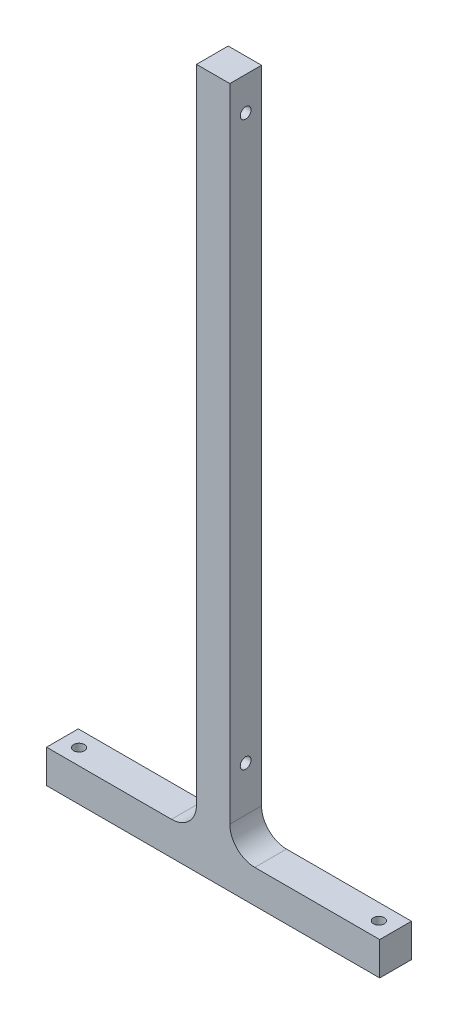
ISO-10303-21;
HEADER;
FILE_DESCRIPTION(('STEP AP214'),'2;1');
FILE_NAME('part.step','',(''),(''),'','','');
FILE_SCHEMA(('AUTOMOTIVE_DESIGN { 1 0 10303 214 1 1 1 1 }'));
ENDSEC;
DATA;
#1=APPLICATION_CONTEXT('core data for automotive mechanical design processes');
#2=APPLICATION_PROTOCOL_DEFINITION('international standard','automotive_design',2000,#1);
#3=PRODUCT_CONTEXT('',#1,'mechanical');
#4=PRODUCT('Part','Part','',(#3));
#5=PRODUCT_RELATED_PRODUCT_CATEGORY('part','',(#4));
#6=PRODUCT_DEFINITION_FORMATION('','',#4);
#7=PRODUCT_DEFINITION_CONTEXT('part definition',#1,'design');
#8=PRODUCT_DEFINITION('design','',#6,#7);
#9=PRODUCT_DEFINITION_SHAPE('','',#8);
#10=(LENGTH_UNIT() NAMED_UNIT(*) SI_UNIT(.MILLI.,.METRE.));
#11=(NAMED_UNIT(*) PLANE_ANGLE_UNIT() SI_UNIT($,.RADIAN.));
#12=(NAMED_UNIT(*) SI_UNIT($,.STERADIAN.) SOLID_ANGLE_UNIT());
#13=UNCERTAINTY_MEASURE_WITH_UNIT(LENGTH_MEASURE(1.E-05),#10,'distance_accuracy_value','');
#14=(GEOMETRIC_REPRESENTATION_CONTEXT(3) GLOBAL_UNCERTAINTY_ASSIGNED_CONTEXT((#13)) GLOBAL_UNIT_ASSIGNED_CONTEXT((#10,
#11,#12)) REPRESENTATION_CONTEXT('',''));
#15=CARTESIAN_POINT('',(0.,0.,0.));
#16=DIRECTION('',(0.,0.,1.));
#17=DIRECTION('',(1.,0.,0.));
#18=AXIS2_PLACEMENT_3D('',#15,#16,#17);
#19=CARTESIAN_POINT('',(-50.,10.,9.525));
#20=DIRECTION('',(1.,0.,0.));
#21=DIRECTION('',(0.,0.,-1.));
#22=AXIS2_PLACEMENT_3D('',#19,#20,#21);
#23=PLANE('',#22);
#24=DIRECTION('',(0.,-1.,0.));
#25=VECTOR('',#24,1.);
#26=CARTESIAN_POINT('',(-50.,10.,0.));
#27=LINE('',#26,#25);
#28=CARTESIAN_POINT('',(-50.,10.,0.));
#29=VERTEX_POINT('',#28);
#30=CARTESIAN_POINT('',(-50.,0.,0.));
#31=VERTEX_POINT('',#30);
#32=EDGE_CURVE('E133',#29,#31,#27,.T.);
#33=ORIENTED_EDGE('',*,*,#32,.T.);
#34=DIRECTION('',(0.,0.,-1.));
#35=VECTOR('',#34,1.);
#36=CARTESIAN_POINT('',(-50.,0.,9.525));
#37=LINE('',#36,#35);
#38=CARTESIAN_POINT('',(-50.,0.,9.525));
#39=VERTEX_POINT('',#38);
#40=EDGE_CURVE('E114',#39,#31,#37,.T.);
#41=ORIENTED_EDGE('',*,*,#40,.F.);
#42=DIRECTION('',(0.,-1.,0.));
#43=VECTOR('',#42,1.);
#44=CARTESIAN_POINT('',(-50.,10.,9.525));
#45=LINE('',#44,#43);
#46=CARTESIAN_POINT('',(-50.,10.,9.525));
#47=VERTEX_POINT('',#46);
#48=EDGE_CURVE('E121',#47,#39,#45,.T.);
#49=ORIENTED_EDGE('',*,*,#48,.F.);
#50=DIRECTION('',(0.,0.,-1.));
#51=VECTOR('',#50,1.);
#52=CARTESIAN_POINT('',(-50.,10.,9.525));
#53=LINE('',#52,#51);
#54=EDGE_CURVE('E161',#47,#29,#53,.T.);
#55=ORIENTED_EDGE('',*,*,#54,.T.);
#56=EDGE_LOOP('',(#33,#41,#49,#55));
#57=FACE_BOUND('',#56,.T.);
#58=ADVANCED_FACE('F33',(#57),#23,.F.);
#59=CARTESIAN_POINT('',(-50.,0.,9.525));
#60=DIRECTION('',(0.,1.,0.));
#61=DIRECTION('',(0.,0.,1.));
#62=AXIS2_PLACEMENT_3D('',#59,#60,#61);
#63=PLANE('',#62);
#64=CARTESIAN_POINT('',(45.,0.,4.76249999999999));
#65=DIRECTION('',(0.,1.,0.));
#66=DIRECTION('',(1.,0.,0.));
#67=AXIS2_PLACEMENT_3D('',#64,#65,#66);
#68=CIRCLE('',#67,1.625);
#69=CARTESIAN_POINT('',(46.625,0.,4.76249999999999));
#70=VERTEX_POINT('',#69);
#71=EDGE_CURVE('E210',#70,#70,#68,.T.);
#72=ORIENTED_EDGE('',*,*,#71,.T.);
#73=EDGE_LOOP('',(#72));
#74=FACE_BOUND('',#73,.T.);
#75=CARTESIAN_POINT('',(-45.,0.,4.7625));
#76=DIRECTION('',(0.,1.,0.));
#77=DIRECTION('',(-1.,0.,0.));
#78=AXIS2_PLACEMENT_3D('',#75,#76,#77);
#79=CIRCLE('',#78,1.625);
#80=CARTESIAN_POINT('',(-46.625,0.,4.7625));
#81=VERTEX_POINT('',#80);
#82=EDGE_CURVE('E198',#81,#81,#79,.T.);
#83=ORIENTED_EDGE('',*,*,#82,.T.);
#84=EDGE_LOOP('',(#83));
#85=FACE_BOUND('',#84,.T.);
#86=DIRECTION('',(1.,0.,0.));
#87=VECTOR('',#86,1.);
#88=CARTESIAN_POINT('',(-50.,0.,0.));
#89=LINE('',#88,#87);
#90=CARTESIAN_POINT('',(50.,0.,0.));
#91=VERTEX_POINT('',#90);
#92=EDGE_CURVE('E194',#31,#91,#89,.T.);
#93=ORIENTED_EDGE('',*,*,#92,.T.);
#94=DIRECTION('',(0.,0.,-1.));
#95=VECTOR('',#94,1.);
#96=CARTESIAN_POINT('',(50.,0.,9.525));
#97=LINE('',#96,#95);
#98=CARTESIAN_POINT('',(50.,0.,9.525));
#99=VERTEX_POINT('',#98);
#100=EDGE_CURVE('E117',#99,#91,#97,.T.);
#101=ORIENTED_EDGE('',*,*,#100,.F.);
#102=DIRECTION('',(1.,0.,0.));
#103=VECTOR('',#102,1.);
#104=CARTESIAN_POINT('',(-50.,0.,9.525));
#105=LINE('',#104,#103);
#106=EDGE_CURVE('E110',#39,#99,#105,.T.);
#107=ORIENTED_EDGE('',*,*,#106,.F.);
#108=ORIENTED_EDGE('',*,*,#40,.T.);
#109=EDGE_LOOP('',(#93,#101,#107,#108));
#110=FACE_BOUND('',#109,.T.);
#111=ADVANCED_FACE('F112',(#74,#85,#110),#63,.F.);
#112=CARTESIAN_POINT('',(50.,0.,9.525));
#113=DIRECTION('',(-1.,0.,0.));
#114=DIRECTION('',(0.,0.,1.));
#115=AXIS2_PLACEMENT_3D('',#112,#113,#114);
#116=PLANE('',#115);
#117=DIRECTION('',(0.,1.,0.));
#118=VECTOR('',#117,1.);
#119=CARTESIAN_POINT('',(50.,0.,0.));
#120=LINE('',#119,#118);
#121=CARTESIAN_POINT('',(50.,10.,0.));
#122=VERTEX_POINT('',#121);
#123=EDGE_CURVE('E192',#91,#122,#120,.T.);
#124=ORIENTED_EDGE('',*,*,#123,.T.);
#125=DIRECTION('',(0.,0.,-1.));
#126=VECTOR('',#125,1.);
#127=CARTESIAN_POINT('',(50.,10.,9.525));
#128=LINE('',#127,#126);
#129=CARTESIAN_POINT('',(50.,10.,9.525));
#130=VERTEX_POINT('',#129);
#131=EDGE_CURVE('E139',#130,#122,#128,.T.);
#132=ORIENTED_EDGE('',*,*,#131,.F.);
#133=DIRECTION('',(0.,1.,0.));
#134=VECTOR('',#133,1.);
#135=CARTESIAN_POINT('',(50.,0.,9.525));
#136=LINE('',#135,#134);
#137=EDGE_CURVE('E120',#99,#130,#136,.T.);
#138=ORIENTED_EDGE('',*,*,#137,.F.);
#139=ORIENTED_EDGE('',*,*,#100,.T.);
#140=EDGE_LOOP('',(#124,#132,#138,#139));
#141=FACE_BOUND('',#140,.T.);
#142=ADVANCED_FACE('F258',(#141),#116,.F.);
#143=CARTESIAN_POINT('',(50.,10.,9.525));
#144=DIRECTION('',(0.,-1.,0.));
#145=DIRECTION('',(0.,0.,-1.));
#146=AXIS2_PLACEMENT_3D('',#143,#144,#145);
#147=PLANE('',#146);
#148=CARTESIAN_POINT('',(45.,10.,4.76249999999999));
#149=DIRECTION('',(0.,1.,0.));
#150=DIRECTION('',(1.,0.,0.));
#151=AXIS2_PLACEMENT_3D('',#148,#149,#150);
#152=CIRCLE('',#151,1.625);
#153=CARTESIAN_POINT('',(46.625,10.,4.76249999999999));
#154=VERTEX_POINT('',#153);
#155=EDGE_CURVE('E213',#154,#154,#152,.T.);
#156=ORIENTED_EDGE('',*,*,#155,.F.);
#157=EDGE_LOOP('',(#156));
#158=FACE_BOUND('',#157,.T.);
#159=DIRECTION('',(-1.,0.,0.));
#160=VECTOR('',#159,1.);
#161=CARTESIAN_POINT('',(50.,10.,0.));
#162=LINE('',#161,#160);
#163=CARTESIAN_POINT('',(12.5,10.,0.));
#164=VERTEX_POINT('',#163);
#165=EDGE_CURVE('E188',#122,#164,#162,.T.);
#166=ORIENTED_EDGE('',*,*,#165,.T.);
#167=DIRECTION('',(0.,0.,-1.));
#168=VECTOR('',#167,1.);
#169=CARTESIAN_POINT('',(12.5,10.,9.525));
#170=LINE('',#169,#168);
#171=CARTESIAN_POINT('',(12.5,10.,9.525));
#172=VERTEX_POINT('',#171);
#173=EDGE_CURVE('E48',#164,#172,#170,.F.);
#174=ORIENTED_EDGE('',*,*,#173,.T.);
#175=DIRECTION('',(-1.,0.,0.));
#176=VECTOR('',#175,1.);
#177=CARTESIAN_POINT('',(50.,10.,9.525));
#178=LINE('',#177,#176);
#179=EDGE_CURVE('E189',#130,#172,#178,.T.);
#180=ORIENTED_EDGE('',*,*,#179,.F.);
#181=ORIENTED_EDGE('',*,*,#131,.T.);
#182=EDGE_LOOP('',(#166,#174,#180,#181));
#183=FACE_BOUND('',#182,.T.);
#184=ADVANCED_FACE('F187',(#158,#183),#147,.F.);
#185=CARTESIAN_POINT('',(5.,10.,9.525));
#186=DIRECTION('',(-1.,0.,0.));
#187=DIRECTION('',(0.,0.,1.));
#188=AXIS2_PLACEMENT_3D('',#185,#186,#187);
#189=PLANE('',#188);
#190=CARTESIAN_POINT('',(5.,200.,4.76249999999998));
#191=DIRECTION('',(-1.,0.,0.));
#192=DIRECTION('',(0.,0.,1.));
#193=AXIS2_PLACEMENT_3D('',#190,#191,#192);
#194=CIRCLE('',#193,1.625);
#195=CARTESIAN_POINT('',(5.,200.,6.38749999999998));
#196=VERTEX_POINT('',#195);
#197=EDGE_CURVE('E224',#196,#196,#194,.T.);
#198=ORIENTED_EDGE('',*,*,#197,.T.);
#199=EDGE_LOOP('',(#198));
#200=FACE_BOUND('',#199,.T.);
#201=CARTESIAN_POINT('',(5.,31.,4.7625));
#202=DIRECTION('',(-1.,0.,0.));
#203=DIRECTION('',(0.,0.,1.));
#204=AXIS2_PLACEMENT_3D('',#201,#202,#203);
#205=CIRCLE('',#204,1.625);
#206=CARTESIAN_POINT('',(5.,31.,6.3875));
#207=VERTEX_POINT('',#206);
#208=EDGE_CURVE('E216',#207,#207,#205,.T.);
#209=ORIENTED_EDGE('',*,*,#208,.T.);
#210=EDGE_LOOP('',(#209));
#211=FACE_BOUND('',#210,.T.);
#212=DIRECTION('',(0.,1.,0.));
#213=VECTOR('',#212,1.);
#214=CARTESIAN_POINT('',(5.,10.,9.525));
#215=LINE('',#214,#213);
#216=CARTESIAN_POINT('',(5.,17.5,9.525));
#217=VERTEX_POINT('',#216);
#218=CARTESIAN_POINT('',(5.,210.,9.525));
#219=VERTEX_POINT('',#218);
#220=EDGE_CURVE('E203',#217,#219,#215,.T.);
#221=ORIENTED_EDGE('',*,*,#220,.F.);
#222=DIRECTION('',(0.,0.,-1.));
#223=VECTOR('',#222,1.);
#224=CARTESIAN_POINT('',(5.,17.5,0.));
#225=LINE('',#224,#223);
#226=CARTESIAN_POINT('',(5.,17.5,0.));
#227=VERTEX_POINT('',#226);
#228=EDGE_CURVE('E144',#217,#227,#225,.T.);
#229=ORIENTED_EDGE('',*,*,#228,.T.);
#230=DIRECTION('',(0.,1.,0.));
#231=VECTOR('',#230,1.);
#232=CARTESIAN_POINT('',(5.,10.,0.));
#233=LINE('',#232,#231);
#234=CARTESIAN_POINT('',(5.,210.,0.));
#235=VERTEX_POINT('',#234);
#236=EDGE_CURVE('E177',#227,#235,#233,.T.);
#237=ORIENTED_EDGE('',*,*,#236,.T.);
#238=DIRECTION('',(0.,0.,-1.));
#239=VECTOR('',#238,1.);
#240=CARTESIAN_POINT('',(5.,210.,9.525));
#241=LINE('',#240,#239);
#242=EDGE_CURVE('E183',#219,#235,#241,.T.);
#243=ORIENTED_EDGE('',*,*,#242,.F.);
#244=EDGE_LOOP('',(#221,#229,#237,#243));
#245=FACE_BOUND('',#244,.T.);
#246=ADVANCED_FACE('F247',(#200,#211,#245),#189,.F.);
#247=CARTESIAN_POINT('',(5.,210.,9.525));
#248=DIRECTION('',(0.,-1.,0.));
#249=DIRECTION('',(0.,0.,-1.));
#250=AXIS2_PLACEMENT_3D('',#247,#248,#249);
#251=PLANE('',#250);
#252=DIRECTION('',(-1.,0.,0.));
#253=VECTOR('',#252,1.);
#254=CARTESIAN_POINT('',(5.,210.,0.));
#255=LINE('',#254,#253);
#256=CARTESIAN_POINT('',(-5.,210.,0.));
#257=VERTEX_POINT('',#256);
#258=EDGE_CURVE('E174',#235,#257,#255,.T.);
#259=ORIENTED_EDGE('',*,*,#258,.T.);
#260=DIRECTION('',(0.,0.,-1.));
#261=VECTOR('',#260,1.);
#262=CARTESIAN_POINT('',(-5.,210.,9.525));
#263=LINE('',#262,#261);
#264=CARTESIAN_POINT('',(-5.,210.,9.525));
#265=VERTEX_POINT('',#264);
#266=EDGE_CURVE('E173',#265,#257,#263,.T.);
#267=ORIENTED_EDGE('',*,*,#266,.F.);
#268=DIRECTION('',(-1.,0.,0.));
#269=VECTOR('',#268,1.);
#270=CARTESIAN_POINT('',(5.,210.,9.525));
#271=LINE('',#270,#269);
#272=EDGE_CURVE('E201',#219,#265,#271,.T.);
#273=ORIENTED_EDGE('',*,*,#272,.F.);
#274=ORIENTED_EDGE('',*,*,#242,.T.);
#275=EDGE_LOOP('',(#259,#267,#273,#274));
#276=FACE_BOUND('',#275,.T.);
#277=ADVANCED_FACE('F236',(#276),#251,.F.);
#278=CARTESIAN_POINT('',(-5.,210.,9.525));
#279=DIRECTION('',(1.,0.,0.));
#280=DIRECTION('',(0.,1.,0.));
#281=AXIS2_PLACEMENT_3D('',#278,#279,#280);
#282=PLANE('',#281);
#283=CARTESIAN_POINT('',(-5.,200.,4.76249999999998));
#284=DIRECTION('',(-1.,0.,0.));
#285=DIRECTION('',(0.,-1.,0.));
#286=AXIS2_PLACEMENT_3D('',#283,#284,#285);
#287=CIRCLE('',#286,1.625);
#288=CARTESIAN_POINT('',(-5.,198.375,4.76249999999998));
#289=VERTEX_POINT('',#288);
#290=EDGE_CURVE('E227',#289,#289,#287,.T.);
#291=ORIENTED_EDGE('',*,*,#290,.F.);
#292=EDGE_LOOP('',(#291));
#293=FACE_BOUND('',#292,.T.);
#294=CARTESIAN_POINT('',(-4.99999999999999,31.,4.7625));
#295=DIRECTION('',(-1.,0.,0.));
#296=DIRECTION('',(0.,-1.,0.));
#297=AXIS2_PLACEMENT_3D('',#294,#295,#296);
#298=CIRCLE('',#297,1.625);
#299=CARTESIAN_POINT('',(-4.99999999999999,29.375,4.7625));
#300=VERTEX_POINT('',#299);
#301=EDGE_CURVE('E221',#300,#300,#298,.T.);
#302=ORIENTED_EDGE('',*,*,#301,.F.);
#303=EDGE_LOOP('',(#302));
#304=FACE_BOUND('',#303,.T.);
#305=DIRECTION('',(0.,-1.,0.));
#306=VECTOR('',#305,1.);
#307=CARTESIAN_POINT('',(-5.,210.,0.));
#308=LINE('',#307,#306);
#309=CARTESIAN_POINT('',(-4.99999999999999,17.5,0.));
#310=VERTEX_POINT('',#309);
#311=EDGE_CURVE('E168',#257,#310,#308,.T.);
#312=ORIENTED_EDGE('',*,*,#311,.T.);
#313=DIRECTION('',(0.,0.,-1.));
#314=VECTOR('',#313,1.);
#315=CARTESIAN_POINT('',(-4.99999999999999,17.5,9.525));
#316=LINE('',#315,#314);
#317=CARTESIAN_POINT('',(-4.99999999999999,17.5,9.525));
#318=VERTEX_POINT('',#317);
#319=EDGE_CURVE('E137',#310,#318,#316,.F.);
#320=ORIENTED_EDGE('',*,*,#319,.T.);
#321=DIRECTION('',(0.,-1.,0.));
#322=VECTOR('',#321,1.);
#323=CARTESIAN_POINT('',(-5.,210.,9.525));
#324=LINE('',#323,#322);
#325=EDGE_CURVE('E154',#265,#318,#324,.T.);
#326=ORIENTED_EDGE('',*,*,#325,.F.);
#327=ORIENTED_EDGE('',*,*,#266,.T.);
#328=EDGE_LOOP('',(#312,#320,#326,#327));
#329=FACE_BOUND('',#328,.T.);
#330=ADVANCED_FACE('F171',(#293,#304,#329),#282,.F.);
#331=CARTESIAN_POINT('',(-4.99999999999999,10.,9.525));
#332=DIRECTION('',(0.,-1.,0.));
#333=DIRECTION('',(1.,0.,0.));
#334=AXIS2_PLACEMENT_3D('',#331,#332,#333);
#335=PLANE('',#334);
#336=CARTESIAN_POINT('',(-45.,10.,4.7625));
#337=DIRECTION('',(0.,1.,0.));
#338=DIRECTION('',(-1.,0.,0.));
#339=AXIS2_PLACEMENT_3D('',#336,#337,#338);
#340=CIRCLE('',#339,1.625);
#341=CARTESIAN_POINT('',(-46.625,10.,4.7625));
#342=VERTEX_POINT('',#341);
#343=EDGE_CURVE('E207',#342,#342,#340,.T.);
#344=ORIENTED_EDGE('',*,*,#343,.F.);
#345=EDGE_LOOP('',(#344));
#346=FACE_BOUND('',#345,.T.);
#347=DIRECTION('',(-1.,0.,0.));
#348=VECTOR('',#347,1.);
#349=CARTESIAN_POINT('',(-4.99999999999999,10.,9.525));
#350=LINE('',#349,#348);
#351=CARTESIAN_POINT('',(-12.5,10.,9.525));
#352=VERTEX_POINT('',#351);
#353=EDGE_CURVE('E126',#352,#47,#350,.T.);
#354=ORIENTED_EDGE('',*,*,#353,.F.);
#355=DIRECTION('',(0.,0.,-1.));
#356=VECTOR('',#355,1.);
#357=CARTESIAN_POINT('',(-12.5,10.,0.));
#358=LINE('',#357,#356);
#359=CARTESIAN_POINT('',(-12.5,10.,0.));
#360=VERTEX_POINT('',#359);
#361=EDGE_CURVE('E134',#352,#360,#358,.T.);
#362=ORIENTED_EDGE('',*,*,#361,.T.);
#363=DIRECTION('',(-1.,0.,0.));
#364=VECTOR('',#363,1.);
#365=CARTESIAN_POINT('',(-4.99999999999999,10.,0.));
#366=LINE('',#365,#364);
#367=EDGE_CURVE('E130',#360,#29,#366,.T.);
#368=ORIENTED_EDGE('',*,*,#367,.T.);
#369=ORIENTED_EDGE('',*,*,#54,.F.);
#370=EDGE_LOOP('',(#354,#362,#368,#369));
#371=FACE_BOUND('',#370,.T.);
#372=ADVANCED_FACE('F159',(#346,#371),#335,.F.);
#373=CARTESIAN_POINT('',(0.,0.,9.525));
#374=DIRECTION('',(0.,0.,1.));
#375=DIRECTION('',(1.,0.,0.));
#376=AXIS2_PLACEMENT_3D('',#373,#374,#375);
#377=PLANE('',#376);
#378=ORIENTED_EDGE('',*,*,#48,.T.);
#379=ORIENTED_EDGE('',*,*,#106,.T.);
#380=ORIENTED_EDGE('',*,*,#137,.T.);
#381=ORIENTED_EDGE('',*,*,#179,.T.);
#382=CARTESIAN_POINT('',(12.5,17.5,9.525));
#383=DIRECTION('',(0.,0.,1.));
#384=DIRECTION('',(1.,0.,0.));
#385=AXIS2_PLACEMENT_3D('',#382,#383,#384);
#386=CIRCLE('',#385,7.5);
#387=EDGE_CURVE('E11',#172,#217,#386,.F.);
#388=ORIENTED_EDGE('',*,*,#387,.T.);
#389=ORIENTED_EDGE('',*,*,#220,.T.);
#390=ORIENTED_EDGE('',*,*,#272,.T.);
#391=ORIENTED_EDGE('',*,*,#325,.T.);
#392=CARTESIAN_POINT('',(-12.5,17.5,9.525));
#393=DIRECTION('',(0.,0.,1.));
#394=DIRECTION('',(1.,0.,0.));
#395=AXIS2_PLACEMENT_3D('',#392,#393,#394);
#396=CIRCLE('',#395,7.5);
#397=EDGE_CURVE('E150',#318,#352,#396,.F.);
#398=ORIENTED_EDGE('',*,*,#397,.T.);
#399=ORIENTED_EDGE('',*,*,#353,.T.);
#400=EDGE_LOOP('',(#378,#379,#380,#381,#388,#389,#390,#391,#398,#399));
#401=FACE_BOUND('',#400,.T.);
#402=ADVANCED_FACE('F124',(#401),#377,.T.);
#403=CARTESIAN_POINT('',(0.,0.,0.));
#404=DIRECTION('',(0.,0.,1.));
#405=DIRECTION('',(1.,0.,0.));
#406=AXIS2_PLACEMENT_3D('',#403,#404,#405);
#407=PLANE('',#406);
#408=ORIENTED_EDGE('',*,*,#32,.F.);
#409=ORIENTED_EDGE('',*,*,#367,.F.);
#410=CARTESIAN_POINT('',(-12.5,17.5,0.));
#411=DIRECTION('',(0.,0.,1.));
#412=DIRECTION('',(1.,0.,0.));
#413=AXIS2_PLACEMENT_3D('',#410,#411,#412);
#414=CIRCLE('',#413,7.5);
#415=EDGE_CURVE('E148',#360,#310,#414,.T.);
#416=ORIENTED_EDGE('',*,*,#415,.T.);
#417=ORIENTED_EDGE('',*,*,#311,.F.);
#418=ORIENTED_EDGE('',*,*,#258,.F.);
#419=ORIENTED_EDGE('',*,*,#236,.F.);
#420=CARTESIAN_POINT('',(12.5,17.5,0.));
#421=DIRECTION('',(0.,0.,1.));
#422=DIRECTION('',(1.,0.,0.));
#423=AXIS2_PLACEMENT_3D('',#420,#421,#422);
#424=CIRCLE('',#423,7.5);
#425=EDGE_CURVE('E41',#227,#164,#424,.T.);
#426=ORIENTED_EDGE('',*,*,#425,.T.);
#427=ORIENTED_EDGE('',*,*,#165,.F.);
#428=ORIENTED_EDGE('',*,*,#123,.F.);
#429=ORIENTED_EDGE('',*,*,#92,.F.);
#430=EDGE_LOOP('',(#408,#409,#416,#417,#418,#419,#426,#427,#428,#429));
#431=FACE_BOUND('',#430,.T.);
#432=ADVANCED_FACE('F166',(#431),#407,.F.);
#433=CARTESIAN_POINT('',(-12.5,17.5,9.525));
#434=DIRECTION('',(0.,0.,1.));
#435=DIRECTION('',(1.,0.,0.));
#436=AXIS2_PLACEMENT_3D('',#433,#434,#435);
#437=CYLINDRICAL_SURFACE('',#436,7.5);
#438=ORIENTED_EDGE('',*,*,#397,.F.);
#439=ORIENTED_EDGE('',*,*,#319,.F.);
#440=ORIENTED_EDGE('',*,*,#415,.F.);
#441=ORIENTED_EDGE('',*,*,#361,.F.);
#442=EDGE_LOOP('',(#438,#439,#440,#441));
#443=FACE_BOUND('',#442,.T.);
#444=ADVANCED_FACE('F163',(#443),#437,.F.);
#445=CARTESIAN_POINT('',(12.5,17.5,9.525));
#446=DIRECTION('',(0.,0.,1.));
#447=DIRECTION('',(1.,0.,0.));
#448=AXIS2_PLACEMENT_3D('',#445,#446,#447);
#449=CYLINDRICAL_SURFACE('',#448,7.5);
#450=ORIENTED_EDGE('',*,*,#387,.F.);
#451=ORIENTED_EDGE('',*,*,#173,.F.);
#452=ORIENTED_EDGE('',*,*,#425,.F.);
#453=ORIENTED_EDGE('',*,*,#228,.F.);
#454=EDGE_LOOP('',(#450,#451,#452,#453));
#455=FACE_BOUND('',#454,.T.);
#456=ADVANCED_FACE('F35',(#455),#449,.F.);
#457=CARTESIAN_POINT('',(-45.,0.,4.7625));
#458=DIRECTION('',(0.,1.,0.));
#459=DIRECTION('',(-1.,0.,0.));
#460=AXIS2_PLACEMENT_3D('',#457,#458,#459);
#461=CYLINDRICAL_SURFACE('',#460,1.625);
#462=ORIENTED_EDGE('',*,*,#82,.F.);
#463=EDGE_LOOP('',(#462));
#464=FACE_BOUND('',#463,.T.);
#465=ORIENTED_EDGE('',*,*,#343,.T.);
#466=EDGE_LOOP('',(#465));
#467=FACE_BOUND('',#466,.T.);
#468=ADVANCED_FACE('F278',(#464,#467),#461,.F.);
#469=CARTESIAN_POINT('',(45.,0.,4.76249999999999));
#470=DIRECTION('',(0.,1.,0.));
#471=DIRECTION('',(-1.,0.,0.));
#472=AXIS2_PLACEMENT_3D('',#469,#470,#471);
#473=CYLINDRICAL_SURFACE('',#472,1.625);
#474=ORIENTED_EDGE('',*,*,#71,.F.);
#475=EDGE_LOOP('',(#474));
#476=FACE_BOUND('',#475,.T.);
#477=ORIENTED_EDGE('',*,*,#155,.T.);
#478=EDGE_LOOP('',(#477));
#479=FACE_BOUND('',#478,.T.);
#480=ADVANCED_FACE('F243',(#476,#479),#473,.F.);
#481=CARTESIAN_POINT('',(50.,31.,4.7625));
#482=DIRECTION('',(-1.,0.,0.));
#483=DIRECTION('',(0.,-1.,0.));
#484=AXIS2_PLACEMENT_3D('',#481,#482,#483);
#485=CYLINDRICAL_SURFACE('',#484,1.625);
#486=ORIENTED_EDGE('',*,*,#301,.T.);
#487=EDGE_LOOP('',(#486));
#488=FACE_BOUND('',#487,.T.);
#489=ORIENTED_EDGE('',*,*,#208,.F.);
#490=EDGE_LOOP('',(#489));
#491=FACE_BOUND('',#490,.T.);
#492=ADVANCED_FACE('F240',(#488,#491),#485,.F.);
#493=CARTESIAN_POINT('',(50.,200.,4.76249999999998));
#494=DIRECTION('',(-1.,0.,0.));
#495=DIRECTION('',(0.,-1.,0.));
#496=AXIS2_PLACEMENT_3D('',#493,#494,#495);
#497=CYLINDRICAL_SURFACE('',#496,1.625);
#498=ORIENTED_EDGE('',*,*,#290,.T.);
#499=EDGE_LOOP('',(#498));
#500=FACE_BOUND('',#499,.T.);
#501=ORIENTED_EDGE('',*,*,#197,.F.);
#502=EDGE_LOOP('',(#501));
#503=FACE_BOUND('',#502,.T.);
#504=ADVANCED_FACE('F231',(#500,#503),#497,.F.);
#505=CLOSED_SHELL('',(#58,#111,#142,#184,#246,#277,#330,#372,#402,#432,#444,#456,#468,#480,#492,#504));
#506=MANIFOLD_SOLID_BREP('B2',#505);
#507=ADVANCED_BREP_SHAPE_REPRESENTATION('',(#18,#506),#14);
#508=SHAPE_DEFINITION_REPRESENTATION(#9,#507);
ENDSEC;
END-ISO-10303-21;
